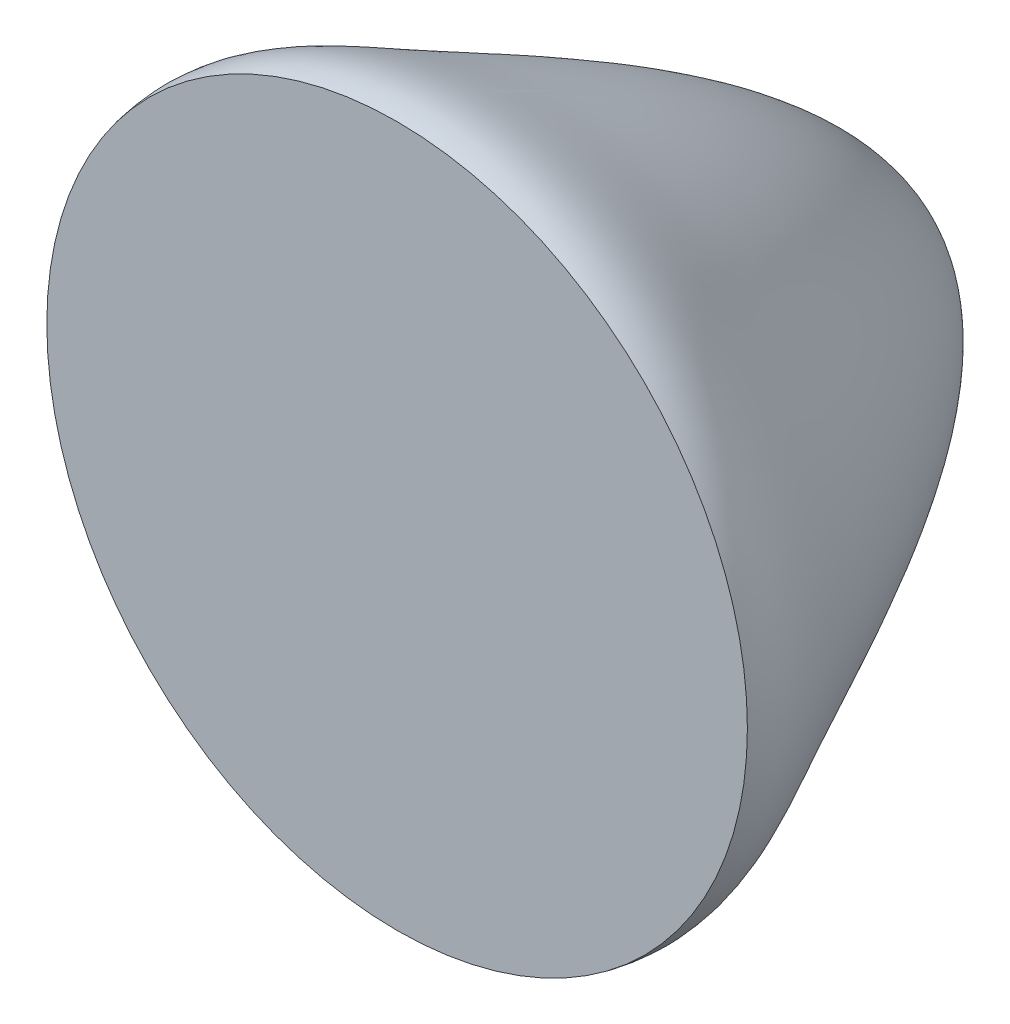
ISO-10303-21;
HEADER;
FILE_DESCRIPTION(('STEP AP214'),'2;1');
FILE_NAME('part.step','',(''),(''),'','','');
FILE_SCHEMA(('AUTOMOTIVE_DESIGN { 1 0 10303 214 1 1 1 1 }'));
ENDSEC;
DATA;
#1=APPLICATION_CONTEXT('core data for automotive mechanical design processes');
#2=APPLICATION_PROTOCOL_DEFINITION('international standard','automotive_design',2000,#1);
#3=PRODUCT_CONTEXT('',#1,'mechanical');
#4=PRODUCT('Part','Part','',(#3));
#5=PRODUCT_RELATED_PRODUCT_CATEGORY('part','',(#4));
#6=PRODUCT_DEFINITION_FORMATION('','',#4);
#7=PRODUCT_DEFINITION_CONTEXT('part definition',#1,'design');
#8=PRODUCT_DEFINITION('design','',#6,#7);
#9=PRODUCT_DEFINITION_SHAPE('','',#8);
#10=(LENGTH_UNIT() NAMED_UNIT(*) SI_UNIT(.MILLI.,.METRE.));
#11=(NAMED_UNIT(*) PLANE_ANGLE_UNIT() SI_UNIT($,.RADIAN.));
#12=(NAMED_UNIT(*) SI_UNIT($,.STERADIAN.) SOLID_ANGLE_UNIT());
#13=UNCERTAINTY_MEASURE_WITH_UNIT(LENGTH_MEASURE(1.E-05),#10,'distance_accuracy_value','');
#14=(GEOMETRIC_REPRESENTATION_CONTEXT(3) GLOBAL_UNCERTAINTY_ASSIGNED_CONTEXT((#13)) GLOBAL_UNIT_ASSIGNED_CONTEXT((#10,
#11,#12)) REPRESENTATION_CONTEXT('',''));
#15=CARTESIAN_POINT('',(0.,0.,0.));
#16=DIRECTION('',(0.,0.,1.));
#17=DIRECTION('',(1.,0.,0.));
#18=AXIS2_PLACEMENT_3D('',#15,#16,#17);
#19=CARTESIAN_POINT('',(0.,0.,-1.15));
#20=CARTESIAN_POINT('',(0.,0.319733684083505,-1.15));
#21=CARTESIAN_POINT('',(0.,0.679588811159878,-0.32165049688381));
#22=CARTESIAN_POINT('',(0.,0.821380604207943,-0.0988915868627304));
#23=CARTESIAN_POINT('',(0.,0.8,0.));
#24=B_SPLINE_CURVE_WITH_KNOTS('',3,(#19,#20,#21,#22,#23),.UNSPECIFIED.,.F.,.F.,(4,1,4),(0.,
0.634080944599834,1.),.UNSPECIFIED.);
#25=CARTESIAN_POINT('',(0.,0.,-1.15));
#26=DIRECTION('',(0.,0.,-1.));
#27=AXIS1_PLACEMENT('',#25,#26);
#28=SURFACE_OF_REVOLUTION('',#24,#27);
#29=CARTESIAN_POINT('',(0.,0.,0.));
#30=DIRECTION('',(0.,0.,-1.));
#31=DIRECTION('',(0.,1.,0.));
#32=AXIS2_PLACEMENT_3D('',#29,#30,#31);
#33=CIRCLE('',#32,0.8);
#34=CARTESIAN_POINT('',(0.,0.8,0.));
#35=VERTEX_POINT('',#34);
#36=EDGE_CURVE('E11',#35,#35,#33,.T.);
#37=ORIENTED_EDGE('',*,*,#36,.T.);
#38=EDGE_LOOP('',(#37));
#39=FACE_BOUND('',#38,.T.);
#40=CARTESIAN_POINT('',(0.,0.,-1.15));
#41=VERTEX_POINT('',#40);
#42=VERTEX_LOOP('',#41);
#43=FACE_BOUND('',#42,.T.);
#44=ADVANCED_FACE('F34',(#39,#43),#28,.F.);
#45=CARTESIAN_POINT('',(0.,0.8,0.));
#46=DIRECTION('',(0.,0.,1.));
#47=DIRECTION('',(0.,-1.,0.));
#48=AXIS2_PLACEMENT_3D('',#45,#46,#47);
#49=PLANE('',#48);
#50=ORIENTED_EDGE('',*,*,#36,.F.);
#51=EDGE_LOOP('',(#50));
#52=FACE_BOUND('',#51,.T.);
#53=ADVANCED_FACE('F43',(#52),#49,.T.);
#54=CLOSED_SHELL('',(#44,#53));
#55=MANIFOLD_SOLID_BREP('B2',#54);
#56=ADVANCED_BREP_SHAPE_REPRESENTATION('',(#18,#55),#14);
#57=SHAPE_DEFINITION_REPRESENTATION(#9,#56);
ENDSEC;
END-ISO-10303-21;
